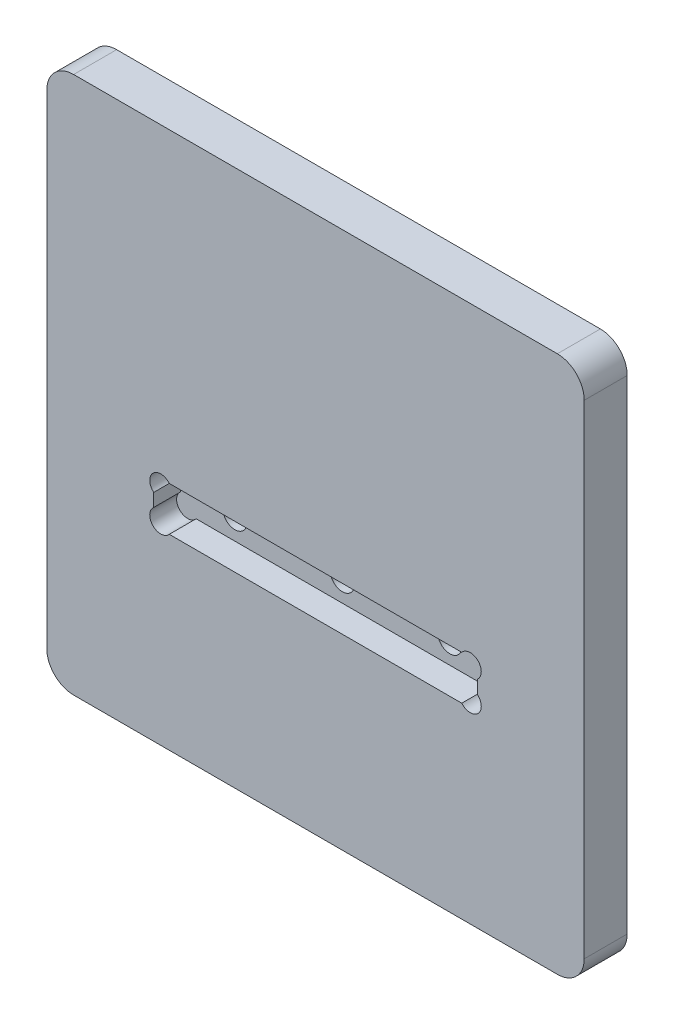
ISO-10303-21;
HEADER;
FILE_DESCRIPTION(('STEP AP214'),'2;1');
FILE_NAME('part.step','',(''),(''),'','','');
FILE_SCHEMA(('AUTOMOTIVE_DESIGN { 1 0 10303 214 1 1 1 1 }'));
ENDSEC;
DATA;
#1=APPLICATION_CONTEXT('core data for automotive mechanical design processes');
#2=APPLICATION_PROTOCOL_DEFINITION('international standard','automotive_design',2000,#1);
#3=PRODUCT_CONTEXT('',#1,'mechanical');
#4=PRODUCT('Part','Part','',(#3));
#5=PRODUCT_RELATED_PRODUCT_CATEGORY('part','',(#4));
#6=PRODUCT_DEFINITION_FORMATION('','',#4);
#7=PRODUCT_DEFINITION_CONTEXT('part definition',#1,'design');
#8=PRODUCT_DEFINITION('design','',#6,#7);
#9=PRODUCT_DEFINITION_SHAPE('','',#8);
#10=(LENGTH_UNIT() NAMED_UNIT(*) SI_UNIT(.MILLI.,.METRE.));
#11=(NAMED_UNIT(*) PLANE_ANGLE_UNIT() SI_UNIT($,.RADIAN.));
#12=(NAMED_UNIT(*) SI_UNIT($,.STERADIAN.) SOLID_ANGLE_UNIT());
#13=UNCERTAINTY_MEASURE_WITH_UNIT(LENGTH_MEASURE(1.E-05),#10,'distance_accuracy_value','');
#14=(GEOMETRIC_REPRESENTATION_CONTEXT(3) GLOBAL_UNCERTAINTY_ASSIGNED_CONTEXT((#13)) GLOBAL_UNIT_ASSIGNED_CONTEXT((#10,
#11,#12)) REPRESENTATION_CONTEXT('',''));
#15=CARTESIAN_POINT('',(0.,0.,0.));
#16=DIRECTION('',(0.,0.,1.));
#17=DIRECTION('',(1.,0.,0.));
#18=AXIS2_PLACEMENT_3D('',#15,#16,#17);
#19=CARTESIAN_POINT('',(0.,0.,8.));
#20=DIRECTION('',(1.,0.,0.));
#21=DIRECTION('',(0.,0.,-1.));
#22=AXIS2_PLACEMENT_3D('',#19,#20,#21);
#23=PLANE('',#22);
#24=DIRECTION('',(0.,-1.,0.));
#25=VECTOR('',#24,1.);
#26=CARTESIAN_POINT('',(0.,0.,0.));
#27=LINE('',#26,#25);
#28=CARTESIAN_POINT('',(0.,95.,0.));
#29=VERTEX_POINT('',#28);
#30=CARTESIAN_POINT('',(0.,5.,0.));
#31=VERTEX_POINT('',#30);
#32=EDGE_CURVE('E175',#29,#31,#27,.T.);
#33=ORIENTED_EDGE('',*,*,#32,.T.);
#34=DIRECTION('',(0.,0.,-1.));
#35=VECTOR('',#34,1.);
#36=CARTESIAN_POINT('',(0.,5.,8.));
#37=LINE('',#36,#35);
#38=CARTESIAN_POINT('',(0.,5.,8.));
#39=VERTEX_POINT('',#38);
#40=EDGE_CURVE('E242',#31,#39,#37,.F.);
#41=ORIENTED_EDGE('',*,*,#40,.T.);
#42=DIRECTION('',(0.,-1.,0.));
#43=VECTOR('',#42,1.);
#44=CARTESIAN_POINT('',(0.,0.,8.));
#45=LINE('',#44,#43);
#46=CARTESIAN_POINT('',(0.,95.,8.));
#47=VERTEX_POINT('',#46);
#48=EDGE_CURVE('E192',#47,#39,#45,.T.);
#49=ORIENTED_EDGE('',*,*,#48,.F.);
#50=DIRECTION('',(0.,0.,-1.));
#51=VECTOR('',#50,1.);
#52=CARTESIAN_POINT('',(0.,95.,8.));
#53=LINE('',#52,#51);
#54=EDGE_CURVE('E239',#47,#29,#53,.T.);
#55=ORIENTED_EDGE('',*,*,#54,.T.);
#56=EDGE_LOOP('',(#33,#41,#49,#55));
#57=FACE_BOUND('',#56,.T.);
#58=ADVANCED_FACE('F33',(#57),#23,.F.);
#59=CARTESIAN_POINT('',(0.,0.,8.));
#60=DIRECTION('',(0.,1.,0.));
#61=DIRECTION('',(0.,0.,1.));
#62=AXIS2_PLACEMENT_3D('',#59,#60,#61);
#63=PLANE('',#62);
#64=DIRECTION('',(1.,0.,0.));
#65=VECTOR('',#64,1.);
#66=CARTESIAN_POINT('',(0.,0.,0.));
#67=LINE('',#66,#65);
#68=CARTESIAN_POINT('',(5.,0.,0.));
#69=VERTEX_POINT('',#68);
#70=CARTESIAN_POINT('',(95.,0.,0.));
#71=VERTEX_POINT('',#70);
#72=EDGE_CURVE('E207',#69,#71,#67,.T.);
#73=ORIENTED_EDGE('',*,*,#72,.T.);
#74=DIRECTION('',(0.,0.,-1.));
#75=VECTOR('',#74,1.);
#76=CARTESIAN_POINT('',(95.,0.,8.));
#77=LINE('',#76,#75);
#78=CARTESIAN_POINT('',(95.,0.,8.));
#79=VERTEX_POINT('',#78);
#80=EDGE_CURVE('E229',#71,#79,#77,.F.);
#81=ORIENTED_EDGE('',*,*,#80,.T.);
#82=DIRECTION('',(1.,0.,0.));
#83=VECTOR('',#82,1.);
#84=CARTESIAN_POINT('',(0.,0.,8.));
#85=LINE('',#84,#83);
#86=CARTESIAN_POINT('',(5.,0.,8.));
#87=VERTEX_POINT('',#86);
#88=EDGE_CURVE('E195',#87,#79,#85,.T.);
#89=ORIENTED_EDGE('',*,*,#88,.F.);
#90=DIRECTION('',(0.,0.,-1.));
#91=VECTOR('',#90,1.);
#92=CARTESIAN_POINT('',(5.,0.,8.));
#93=LINE('',#92,#91);
#94=EDGE_CURVE('E226',#87,#69,#93,.T.);
#95=ORIENTED_EDGE('',*,*,#94,.T.);
#96=EDGE_LOOP('',(#73,#81,#89,#95));
#97=FACE_BOUND('',#96,.T.);
#98=ADVANCED_FACE('F319',(#97),#63,.F.);
#99=CARTESIAN_POINT('',(100.,0.,8.));
#100=DIRECTION('',(-1.,0.,0.));
#101=DIRECTION('',(0.,0.,1.));
#102=AXIS2_PLACEMENT_3D('',#99,#100,#101);
#103=PLANE('',#102);
#104=DIRECTION('',(0.,1.,0.));
#105=VECTOR('',#104,1.);
#106=CARTESIAN_POINT('',(100.,0.,8.));
#107=LINE('',#106,#105);
#108=CARTESIAN_POINT('',(100.,5.,8.));
#109=VERTEX_POINT('',#108);
#110=CARTESIAN_POINT('',(100.,95.,8.));
#111=VERTEX_POINT('',#110);
#112=EDGE_CURVE('E199',#109,#111,#107,.T.);
#113=ORIENTED_EDGE('',*,*,#112,.F.);
#114=DIRECTION('',(0.,0.,-1.));
#115=VECTOR('',#114,1.);
#116=CARTESIAN_POINT('',(100.,5.,8.));
#117=LINE('',#116,#115);
#118=CARTESIAN_POINT('',(100.,5.,0.));
#119=VERTEX_POINT('',#118);
#120=EDGE_CURVE('E215',#109,#119,#117,.T.);
#121=ORIENTED_EDGE('',*,*,#120,.T.);
#122=DIRECTION('',(0.,1.,0.));
#123=VECTOR('',#122,1.);
#124=CARTESIAN_POINT('',(100.,0.,0.));
#125=LINE('',#124,#123);
#126=CARTESIAN_POINT('',(100.,95.,0.));
#127=VERTEX_POINT('',#126);
#128=EDGE_CURVE('E210',#119,#127,#125,.T.);
#129=ORIENTED_EDGE('',*,*,#128,.T.);
#130=DIRECTION('',(0.,0.,-1.));
#131=VECTOR('',#130,1.);
#132=CARTESIAN_POINT('',(100.,95.,8.));
#133=LINE('',#132,#131);
#134=EDGE_CURVE('E204',#127,#111,#133,.F.);
#135=ORIENTED_EDGE('',*,*,#134,.T.);
#136=EDGE_LOOP('',(#113,#121,#129,#135));
#137=FACE_BOUND('',#136,.T.);
#138=ADVANCED_FACE('F325',(#137),#103,.F.);
#139=CARTESIAN_POINT('',(0.,100.,8.));
#140=DIRECTION('',(0.,-1.,0.));
#141=DIRECTION('',(0.,0.,-1.));
#142=AXIS2_PLACEMENT_3D('',#139,#140,#141);
#143=PLANE('',#142);
#144=DIRECTION('',(-1.,0.,0.));
#145=VECTOR('',#144,1.);
#146=CARTESIAN_POINT('',(0.,100.,0.));
#147=LINE('',#146,#145);
#148=CARTESIAN_POINT('',(95.,100.,0.));
#149=VERTEX_POINT('',#148);
#150=CARTESIAN_POINT('',(5.,100.,0.));
#151=VERTEX_POINT('',#150);
#152=EDGE_CURVE('E196',#149,#151,#147,.T.);
#153=ORIENTED_EDGE('',*,*,#152,.T.);
#154=DIRECTION('',(0.,0.,-1.));
#155=VECTOR('',#154,1.);
#156=CARTESIAN_POINT('',(5.,100.,8.));
#157=LINE('',#156,#155);
#158=CARTESIAN_POINT('',(5.,100.,8.));
#159=VERTEX_POINT('',#158);
#160=EDGE_CURVE('E11',#151,#159,#157,.F.);
#161=ORIENTED_EDGE('',*,*,#160,.T.);
#162=DIRECTION('',(-1.,0.,0.));
#163=VECTOR('',#162,1.);
#164=CARTESIAN_POINT('',(0.,100.,8.));
#165=LINE('',#164,#163);
#166=CARTESIAN_POINT('',(95.,100.,8.));
#167=VERTEX_POINT('',#166);
#168=EDGE_CURVE('E202',#167,#159,#165,.T.);
#169=ORIENTED_EDGE('',*,*,#168,.F.);
#170=DIRECTION('',(0.,0.,-1.));
#171=VECTOR('',#170,1.);
#172=CARTESIAN_POINT('',(95.,100.,8.));
#173=LINE('',#172,#171);
#174=EDGE_CURVE('E42',#167,#149,#173,.T.);
#175=ORIENTED_EDGE('',*,*,#174,.T.);
#176=EDGE_LOOP('',(#153,#161,#169,#175));
#177=FACE_BOUND('',#176,.T.);
#178=ADVANCED_FACE('F362',(#177),#143,.F.);
#179=CARTESIAN_POINT('',(0.,0.,8.));
#180=DIRECTION('',(0.,0.,-1.));
#181=DIRECTION('',(-1.,0.,0.));
#182=AXIS2_PLACEMENT_3D('',#179,#180,#181);
#183=PLANE('',#182);
#184=DIRECTION('',(0.,1.,0.));
#185=VECTOR('',#184,1.);
#186=CARTESIAN_POINT('',(80.1,43.,8.));
#187=LINE('',#186,#185);
#188=CARTESIAN_POINT('',(80.1,37.6865169569615,8.));
#189=VERTEX_POINT('',#188);
#190=CARTESIAN_POINT('',(80.1,40.1134830430385,8.));
#191=VERTEX_POINT('',#190);
#192=EDGE_CURVE('E187',#189,#191,#187,.T.);
#193=ORIENTED_EDGE('',*,*,#192,.F.);
#194=CARTESIAN_POINT('',(78.7918524548049,36.1081475451951,8.));
#195=DIRECTION('',(0.,0.,1.));
#196=DIRECTION('',(1.,0.,0.));
#197=AXIS2_PLACEMENT_3D('',#194,#195,#196);
#198=CIRCLE('',#197,2.05);
#199=CARTESIAN_POINT('',(77.2134830430384,34.8,8.));
#200=VERTEX_POINT('',#199);
#201=EDGE_CURVE('E154',#200,#189,#198,.T.);
#202=ORIENTED_EDGE('',*,*,#201,.F.);
#203=DIRECTION('',(1.,0.,0.));
#204=VECTOR('',#203,1.);
#205=CARTESIAN_POINT('',(19.9,34.8,8.));
#206=LINE('',#205,#204);
#207=CARTESIAN_POINT('',(22.7865169569616,34.8,8.));
#208=VERTEX_POINT('',#207);
#209=EDGE_CURVE('E184',#208,#200,#206,.T.);
#210=ORIENTED_EDGE('',*,*,#209,.F.);
#211=CARTESIAN_POINT('',(21.2081475451951,36.1081475451951,8.));
#212=DIRECTION('',(0.,0.,1.));
#213=DIRECTION('',(-1.,0.,0.));
#214=AXIS2_PLACEMENT_3D('',#211,#212,#213);
#215=CIRCLE('',#214,2.05);
#216=CARTESIAN_POINT('',(19.9,37.6865169569616,8.));
#217=VERTEX_POINT('',#216);
#218=EDGE_CURVE('E272',#217,#208,#215,.T.);
#219=ORIENTED_EDGE('',*,*,#218,.F.);
#220=DIRECTION('',(0.,-1.,0.));
#221=VECTOR('',#220,1.);
#222=CARTESIAN_POINT('',(19.9,43.,8.));
#223=LINE('',#222,#221);
#224=CARTESIAN_POINT('',(19.9,40.1134830430384,8.));
#225=VERTEX_POINT('',#224);
#226=EDGE_CURVE('E181',#225,#217,#223,.T.);
#227=ORIENTED_EDGE('',*,*,#226,.F.);
#228=CARTESIAN_POINT('',(21.2081475451951,41.6918524548049,8.));
#229=DIRECTION('',(0.,0.,1.));
#230=DIRECTION('',(1.,0.,0.));
#231=AXIS2_PLACEMENT_3D('',#228,#229,#230);
#232=CIRCLE('',#231,2.05);
#233=CARTESIAN_POINT('',(22.7865169569616,43.,8.));
#234=VERTEX_POINT('',#233);
#235=EDGE_CURVE('E248',#234,#225,#232,.T.);
#236=ORIENTED_EDGE('',*,*,#235,.F.);
#237=DIRECTION('',(-1.,0.,0.));
#238=VECTOR('',#237,1.);
#239=CARTESIAN_POINT('',(19.9,43.,8.));
#240=LINE('',#239,#238);
#241=CARTESIAN_POINT('',(77.2134830430384,43.,8.));
#242=VERTEX_POINT('',#241);
#243=EDGE_CURVE('E189',#242,#234,#240,.T.);
#244=ORIENTED_EDGE('',*,*,#243,.F.);
#245=CARTESIAN_POINT('',(78.7918524548049,41.6918524548049,8.));
#246=DIRECTION('',(0.,0.,1.));
#247=DIRECTION('',(-1.,0.,0.));
#248=AXIS2_PLACEMENT_3D('',#245,#246,#247);
#249=CIRCLE('',#248,2.05);
#250=EDGE_CURVE('E268',#191,#242,#249,.T.);
#251=ORIENTED_EDGE('',*,*,#250,.F.);
#252=EDGE_LOOP('',(#193,#202,#210,#219,#227,#236,#244,#251));
#253=FACE_BOUND('',#252,.T.);
#254=ORIENTED_EDGE('',*,*,#88,.T.);
#255=CARTESIAN_POINT('',(95.,5.,8.));
#256=DIRECTION('',(0.,0.,-1.));
#257=DIRECTION('',(-1.,0.,0.));
#258=AXIS2_PLACEMENT_3D('',#255,#256,#257);
#259=CIRCLE('',#258,5.);
#260=EDGE_CURVE('E237',#79,#109,#259,.F.);
#261=ORIENTED_EDGE('',*,*,#260,.T.);
#262=ORIENTED_EDGE('',*,*,#112,.T.);
#263=CARTESIAN_POINT('',(95.,95.,8.));
#264=DIRECTION('',(0.,0.,-1.));
#265=DIRECTION('',(-1.,0.,0.));
#266=AXIS2_PLACEMENT_3D('',#263,#264,#265);
#267=CIRCLE('',#266,5.);
#268=EDGE_CURVE('E231',#111,#167,#267,.F.);
#269=ORIENTED_EDGE('',*,*,#268,.T.);
#270=ORIENTED_EDGE('',*,*,#168,.T.);
#271=CARTESIAN_POINT('',(5.,95.,8.));
#272=DIRECTION('',(0.,0.,-1.));
#273=DIRECTION('',(-1.,0.,0.));
#274=AXIS2_PLACEMENT_3D('',#271,#272,#273);
#275=CIRCLE('',#274,5.);
#276=EDGE_CURVE('E233',#159,#47,#275,.F.);
#277=ORIENTED_EDGE('',*,*,#276,.T.);
#278=ORIENTED_EDGE('',*,*,#48,.T.);
#279=CARTESIAN_POINT('',(5.,5.,8.));
#280=DIRECTION('',(0.,0.,-1.));
#281=DIRECTION('',(-1.,0.,0.));
#282=AXIS2_PLACEMENT_3D('',#279,#280,#281);
#283=CIRCLE('',#282,5.);
#284=EDGE_CURVE('E235',#39,#87,#283,.F.);
#285=ORIENTED_EDGE('',*,*,#284,.T.);
#286=EDGE_LOOP('',(#254,#261,#262,#269,#270,#277,#278,#285));
#287=FACE_BOUND('',#286,.T.);
#288=ADVANCED_FACE('F301',(#253,#287),#183,.F.);
#289=CARTESIAN_POINT('',(0.,0.,0.));
#290=DIRECTION('',(0.,0.,-1.));
#291=DIRECTION('',(-1.,0.,0.));
#292=AXIS2_PLACEMENT_3D('',#289,#290,#291);
#293=PLANE('',#292);
#294=CARTESIAN_POINT('',(70.,38.9,0.));
#295=DIRECTION('',(0.,0.,1.));
#296=DIRECTION('',(1.,0.,0.));
#297=AXIS2_PLACEMENT_3D('',#294,#295,#296);
#298=CIRCLE('',#297,2.25);
#299=CARTESIAN_POINT('',(72.25,38.9,0.));
#300=VERTEX_POINT('',#299);
#301=EDGE_CURVE('E252',#300,#300,#298,.T.);
#302=ORIENTED_EDGE('',*,*,#301,.T.);
#303=EDGE_LOOP('',(#302));
#304=FACE_BOUND('',#303,.T.);
#305=CARTESIAN_POINT('',(30.,38.9,0.));
#306=DIRECTION('',(0.,0.,1.));
#307=DIRECTION('',(-1.,0.,0.));
#308=AXIS2_PLACEMENT_3D('',#305,#306,#307);
#309=CIRCLE('',#308,2.25);
#310=CARTESIAN_POINT('',(27.75,38.9,0.));
#311=VERTEX_POINT('',#310);
#312=EDGE_CURVE('E257',#311,#311,#309,.T.);
#313=ORIENTED_EDGE('',*,*,#312,.T.);
#314=EDGE_LOOP('',(#313));
#315=FACE_BOUND('',#314,.T.);
#316=CARTESIAN_POINT('',(50.,38.9,0.));
#317=DIRECTION('',(0.,0.,1.));
#318=DIRECTION('',(1.,0.,0.));
#319=AXIS2_PLACEMENT_3D('',#316,#317,#318);
#320=CIRCLE('',#319,2.25);
#321=CARTESIAN_POINT('',(52.25,38.9,0.));
#322=VERTEX_POINT('',#321);
#323=EDGE_CURVE('E249',#322,#322,#320,.T.);
#324=ORIENTED_EDGE('',*,*,#323,.T.);
#325=EDGE_LOOP('',(#324));
#326=FACE_BOUND('',#325,.T.);
#327=ORIENTED_EDGE('',*,*,#128,.F.);
#328=CARTESIAN_POINT('',(95.,5.,0.));
#329=DIRECTION('',(0.,0.,-1.));
#330=DIRECTION('',(-1.,0.,0.));
#331=AXIS2_PLACEMENT_3D('',#328,#329,#330);
#332=CIRCLE('',#331,5.);
#333=EDGE_CURVE('E224',#119,#71,#332,.T.);
#334=ORIENTED_EDGE('',*,*,#333,.T.);
#335=ORIENTED_EDGE('',*,*,#72,.F.);
#336=CARTESIAN_POINT('',(5.,5.,0.));
#337=DIRECTION('',(0.,0.,-1.));
#338=DIRECTION('',(-1.,0.,0.));
#339=AXIS2_PLACEMENT_3D('',#336,#337,#338);
#340=CIRCLE('',#339,5.);
#341=EDGE_CURVE('E222',#69,#31,#340,.T.);
#342=ORIENTED_EDGE('',*,*,#341,.T.);
#343=ORIENTED_EDGE('',*,*,#32,.F.);
#344=CARTESIAN_POINT('',(5.,95.,0.));
#345=DIRECTION('',(0.,0.,-1.));
#346=DIRECTION('',(-1.,0.,0.));
#347=AXIS2_PLACEMENT_3D('',#344,#345,#346);
#348=CIRCLE('',#347,5.);
#349=EDGE_CURVE('E220',#29,#151,#348,.T.);
#350=ORIENTED_EDGE('',*,*,#349,.T.);
#351=ORIENTED_EDGE('',*,*,#152,.F.);
#352=CARTESIAN_POINT('',(95.,95.,0.));
#353=DIRECTION('',(0.,0.,-1.));
#354=DIRECTION('',(-1.,0.,0.));
#355=AXIS2_PLACEMENT_3D('',#352,#353,#354);
#356=CIRCLE('',#355,5.);
#357=EDGE_CURVE('E218',#149,#127,#356,.T.);
#358=ORIENTED_EDGE('',*,*,#357,.T.);
#359=EDGE_LOOP('',(#327,#334,#335,#342,#343,#350,#351,#358));
#360=FACE_BOUND('',#359,.T.);
#361=ADVANCED_FACE('F365',(#304,#315,#326,#360),#293,.T.);
#362=CARTESIAN_POINT('',(19.9,43.,3.));
#363=DIRECTION('',(-1.,0.,0.));
#364=DIRECTION('',(0.,-1.,0.));
#365=AXIS2_PLACEMENT_3D('',#362,#363,#364);
#366=PLANE('',#365);
#367=ORIENTED_EDGE('',*,*,#226,.T.);
#368=DIRECTION('',(0.,0.,1.));
#369=VECTOR('',#368,1.);
#370=CARTESIAN_POINT('',(19.9,37.6865169569616,3.));
#371=LINE('',#370,#369);
#372=CARTESIAN_POINT('',(19.9,37.6865169569616,3.));
#373=VERTEX_POINT('',#372);
#374=EDGE_CURVE('E267',#373,#217,#371,.T.);
#375=ORIENTED_EDGE('',*,*,#374,.F.);
#376=DIRECTION('',(0.,-1.,0.));
#377=VECTOR('',#376,1.);
#378=CARTESIAN_POINT('',(19.9,43.,3.));
#379=LINE('',#378,#377);
#380=CARTESIAN_POINT('',(19.9,40.1134830430384,3.));
#381=VERTEX_POINT('',#380);
#382=EDGE_CURVE('E177',#381,#373,#379,.T.);
#383=ORIENTED_EDGE('',*,*,#382,.F.);
#384=DIRECTION('',(0.,0.,1.));
#385=VECTOR('',#384,1.);
#386=CARTESIAN_POINT('',(19.9,40.1134830430384,3.));
#387=LINE('',#386,#385);
#388=EDGE_CURVE('E280',#381,#225,#387,.T.);
#389=ORIENTED_EDGE('',*,*,#388,.T.);
#390=EDGE_LOOP('',(#367,#375,#383,#389));
#391=FACE_BOUND('',#390,.T.);
#392=ADVANCED_FACE('F294',(#391),#366,.F.);
#393=CARTESIAN_POINT('',(19.9,43.,3.));
#394=DIRECTION('',(0.,1.,0.));
#395=DIRECTION('',(-1.,0.,0.));
#396=AXIS2_PLACEMENT_3D('',#393,#394,#395);
#397=PLANE('',#396);
#398=ORIENTED_EDGE('',*,*,#243,.T.);
#399=DIRECTION('',(0.,0.,1.));
#400=VECTOR('',#399,1.);
#401=CARTESIAN_POINT('',(22.7865169569616,43.,3.));
#402=LINE('',#401,#400);
#403=CARTESIAN_POINT('',(22.7865169569616,43.,3.));
#404=VERTEX_POINT('',#403);
#405=EDGE_CURVE('E274',#404,#234,#402,.T.);
#406=ORIENTED_EDGE('',*,*,#405,.F.);
#407=DIRECTION('',(-1.,0.,0.));
#408=VECTOR('',#407,1.);
#409=CARTESIAN_POINT('',(19.9,43.,3.));
#410=LINE('',#409,#408);
#411=CARTESIAN_POINT('',(77.2134830430384,43.,3.));
#412=VERTEX_POINT('',#411);
#413=EDGE_CURVE('E172',#412,#404,#410,.T.);
#414=ORIENTED_EDGE('',*,*,#413,.F.);
#415=DIRECTION('',(0.,0.,1.));
#416=VECTOR('',#415,1.);
#417=CARTESIAN_POINT('',(77.2134830430384,43.,3.));
#418=LINE('',#417,#416);
#419=EDGE_CURVE('E287',#412,#242,#418,.T.);
#420=ORIENTED_EDGE('',*,*,#419,.T.);
#421=EDGE_LOOP('',(#398,#406,#414,#420));
#422=FACE_BOUND('',#421,.T.);
#423=ADVANCED_FACE('F315',(#422),#397,.F.);
#424=CARTESIAN_POINT('',(80.1,43.,3.));
#425=DIRECTION('',(1.,0.,0.));
#426=DIRECTION('',(0.,0.,-1.));
#427=AXIS2_PLACEMENT_3D('',#424,#425,#426);
#428=PLANE('',#427);
#429=DIRECTION('',(0.,1.,0.));
#430=VECTOR('',#429,1.);
#431=CARTESIAN_POINT('',(80.1,43.,3.));
#432=LINE('',#431,#430);
#433=CARTESIAN_POINT('',(80.1,37.6865169569615,3.));
#434=VERTEX_POINT('',#433);
#435=CARTESIAN_POINT('',(80.1,40.1134830430385,3.));
#436=VERTEX_POINT('',#435);
#437=EDGE_CURVE('E163',#434,#436,#432,.T.);
#438=ORIENTED_EDGE('',*,*,#437,.F.);
#439=DIRECTION('',(0.,0.,1.));
#440=VECTOR('',#439,1.);
#441=CARTESIAN_POINT('',(80.1,37.6865169569615,3.));
#442=LINE('',#441,#440);
#443=EDGE_CURVE('E148',#434,#189,#442,.T.);
#444=ORIENTED_EDGE('',*,*,#443,.T.);
#445=ORIENTED_EDGE('',*,*,#192,.T.);
#446=DIRECTION('',(0.,0.,1.));
#447=VECTOR('',#446,1.);
#448=CARTESIAN_POINT('',(80.1,40.1134830430385,3.));
#449=LINE('',#448,#447);
#450=EDGE_CURVE('E171',#436,#191,#449,.T.);
#451=ORIENTED_EDGE('',*,*,#450,.F.);
#452=EDGE_LOOP('',(#438,#444,#445,#451));
#453=FACE_BOUND('',#452,.T.);
#454=ADVANCED_FACE('F169',(#453),#428,.F.);
#455=CARTESIAN_POINT('',(19.9,34.8,3.));
#456=DIRECTION('',(0.,-1.,0.));
#457=DIRECTION('',(1.,0.,0.));
#458=AXIS2_PLACEMENT_3D('',#455,#456,#457);
#459=PLANE('',#458);
#460=ORIENTED_EDGE('',*,*,#209,.T.);
#461=DIRECTION('',(0.,0.,1.));
#462=VECTOR('',#461,1.);
#463=CARTESIAN_POINT('',(77.2134830430384,34.8,3.));
#464=LINE('',#463,#462);
#465=CARTESIAN_POINT('',(77.2134830430384,34.8,3.));
#466=VERTEX_POINT('',#465);
#467=EDGE_CURVE('E158',#466,#200,#464,.T.);
#468=ORIENTED_EDGE('',*,*,#467,.F.);
#469=DIRECTION('',(1.,0.,0.));
#470=VECTOR('',#469,1.);
#471=CARTESIAN_POINT('',(19.9,34.8,3.));
#472=LINE('',#471,#470);
#473=CARTESIAN_POINT('',(22.7865169569616,34.8,3.));
#474=VERTEX_POINT('',#473);
#475=EDGE_CURVE('E166',#474,#466,#472,.T.);
#476=ORIENTED_EDGE('',*,*,#475,.F.);
#477=DIRECTION('',(0.,0.,1.));
#478=VECTOR('',#477,1.);
#479=CARTESIAN_POINT('',(22.7865169569616,34.8,3.));
#480=LINE('',#479,#478);
#481=EDGE_CURVE('E271',#474,#208,#480,.T.);
#482=ORIENTED_EDGE('',*,*,#481,.T.);
#483=EDGE_LOOP('',(#460,#468,#476,#482));
#484=FACE_BOUND('',#483,.T.);
#485=ADVANCED_FACE('F305',(#484),#459,.F.);
#486=CARTESIAN_POINT('',(0.,0.,3.));
#487=DIRECTION('',(0.,0.,1.));
#488=DIRECTION('',(1.,0.,0.));
#489=AXIS2_PLACEMENT_3D('',#486,#487,#488);
#490=PLANE('',#489);
#491=CARTESIAN_POINT('',(70.,38.9,3.));
#492=DIRECTION('',(0.,0.,1.));
#493=DIRECTION('',(1.,0.,0.));
#494=AXIS2_PLACEMENT_3D('',#491,#492,#493);
#495=CIRCLE('',#494,2.25);
#496=CARTESIAN_POINT('',(72.25,38.9,3.));
#497=VERTEX_POINT('',#496);
#498=EDGE_CURVE('E37',#497,#497,#495,.T.);
#499=ORIENTED_EDGE('',*,*,#498,.F.);
#500=EDGE_LOOP('',(#499));
#501=FACE_BOUND('',#500,.T.);
#502=CARTESIAN_POINT('',(30.,38.9,3.));
#503=DIRECTION('',(0.,0.,1.));
#504=DIRECTION('',(1.,0.,0.));
#505=AXIS2_PLACEMENT_3D('',#502,#503,#504);
#506=CIRCLE('',#505,2.25);
#507=CARTESIAN_POINT('',(32.25,38.9,3.));
#508=VERTEX_POINT('',#507);
#509=EDGE_CURVE('E250',#508,#508,#506,.T.);
#510=ORIENTED_EDGE('',*,*,#509,.F.);
#511=EDGE_LOOP('',(#510));
#512=FACE_BOUND('',#511,.T.);
#513=CARTESIAN_POINT('',(50.,38.9,3.));
#514=DIRECTION('',(0.,0.,1.));
#515=DIRECTION('',(1.,0.,0.));
#516=AXIS2_PLACEMENT_3D('',#513,#514,#515);
#517=CIRCLE('',#516,2.25);
#518=CARTESIAN_POINT('',(52.25,38.9,3.));
#519=VERTEX_POINT('',#518);
#520=EDGE_CURVE('E246',#519,#519,#517,.T.);
#521=ORIENTED_EDGE('',*,*,#520,.F.);
#522=EDGE_LOOP('',(#521));
#523=FACE_BOUND('',#522,.T.);
#524=CARTESIAN_POINT('',(21.2081475451951,41.6918524548049,3.));
#525=DIRECTION('',(0.,0.,1.));
#526=DIRECTION('',(1.,0.,0.));
#527=AXIS2_PLACEMENT_3D('',#524,#525,#526);
#528=CIRCLE('',#527,2.05);
#529=EDGE_CURVE('E278',#404,#381,#528,.T.);
#530=ORIENTED_EDGE('',*,*,#529,.T.);
#531=ORIENTED_EDGE('',*,*,#382,.T.);
#532=CARTESIAN_POINT('',(21.2081475451951,36.1081475451951,3.));
#533=DIRECTION('',(0.,0.,1.));
#534=DIRECTION('',(-1.,0.,0.));
#535=AXIS2_PLACEMENT_3D('',#532,#533,#534);
#536=CIRCLE('',#535,2.05);
#537=EDGE_CURVE('E50',#373,#474,#536,.T.);
#538=ORIENTED_EDGE('',*,*,#537,.T.);
#539=ORIENTED_EDGE('',*,*,#475,.T.);
#540=CARTESIAN_POINT('',(78.7918524548049,36.1081475451951,3.));
#541=DIRECTION('',(0.,0.,1.));
#542=DIRECTION('',(1.,0.,0.));
#543=AXIS2_PLACEMENT_3D('',#540,#541,#542);
#544=CIRCLE('',#543,2.05);
#545=EDGE_CURVE('E151',#466,#434,#544,.T.);
#546=ORIENTED_EDGE('',*,*,#545,.T.);
#547=ORIENTED_EDGE('',*,*,#437,.T.);
#548=CARTESIAN_POINT('',(78.7918524548049,41.6918524548049,3.));
#549=DIRECTION('',(0.,0.,1.));
#550=DIRECTION('',(-1.,0.,0.));
#551=AXIS2_PLACEMENT_3D('',#548,#549,#550);
#552=CIRCLE('',#551,2.05);
#553=EDGE_CURVE('E285',#436,#412,#552,.T.);
#554=ORIENTED_EDGE('',*,*,#553,.T.);
#555=ORIENTED_EDGE('',*,*,#413,.T.);
#556=EDGE_LOOP('',(#530,#531,#538,#539,#546,#547,#554,#555));
#557=FACE_BOUND('',#556,.T.);
#558=ADVANCED_FACE('F161',(#501,#512,#523,#557),#490,.T.);
#559=CARTESIAN_POINT('',(95.,5.,8.));
#560=DIRECTION('',(0.,0.,-1.));
#561=DIRECTION('',(-1.,0.,0.));
#562=AXIS2_PLACEMENT_3D('',#559,#560,#561);
#563=CYLINDRICAL_SURFACE('',#562,5.);
#564=ORIENTED_EDGE('',*,*,#260,.F.);
#565=ORIENTED_EDGE('',*,*,#80,.F.);
#566=ORIENTED_EDGE('',*,*,#333,.F.);
#567=ORIENTED_EDGE('',*,*,#120,.F.);
#568=EDGE_LOOP('',(#564,#565,#566,#567));
#569=FACE_BOUND('',#568,.T.);
#570=ADVANCED_FACE('F312',(#569),#563,.T.);
#571=CARTESIAN_POINT('',(5.,5.,8.));
#572=DIRECTION('',(0.,0.,-1.));
#573=DIRECTION('',(-1.,0.,0.));
#574=AXIS2_PLACEMENT_3D('',#571,#572,#573);
#575=CYLINDRICAL_SURFACE('',#574,5.);
#576=ORIENTED_EDGE('',*,*,#284,.F.);
#577=ORIENTED_EDGE('',*,*,#40,.F.);
#578=ORIENTED_EDGE('',*,*,#341,.F.);
#579=ORIENTED_EDGE('',*,*,#94,.F.);
#580=EDGE_LOOP('',(#576,#577,#578,#579));
#581=FACE_BOUND('',#580,.T.);
#582=ADVANCED_FACE('F332',(#581),#575,.T.);
#583=CARTESIAN_POINT('',(5.,95.,8.));
#584=DIRECTION('',(0.,0.,-1.));
#585=DIRECTION('',(-1.,0.,0.));
#586=AXIS2_PLACEMENT_3D('',#583,#584,#585);
#587=CYLINDRICAL_SURFACE('',#586,5.);
#588=ORIENTED_EDGE('',*,*,#276,.F.);
#589=ORIENTED_EDGE('',*,*,#160,.F.);
#590=ORIENTED_EDGE('',*,*,#349,.F.);
#591=ORIENTED_EDGE('',*,*,#54,.F.);
#592=EDGE_LOOP('',(#588,#589,#590,#591));
#593=FACE_BOUND('',#592,.T.);
#594=ADVANCED_FACE('F335',(#593),#587,.T.);
#595=CARTESIAN_POINT('',(95.,95.,8.));
#596=DIRECTION('',(0.,0.,-1.));
#597=DIRECTION('',(-1.,0.,0.));
#598=AXIS2_PLACEMENT_3D('',#595,#596,#597);
#599=CYLINDRICAL_SURFACE('',#598,5.);
#600=ORIENTED_EDGE('',*,*,#268,.F.);
#601=ORIENTED_EDGE('',*,*,#134,.F.);
#602=ORIENTED_EDGE('',*,*,#357,.F.);
#603=ORIENTED_EDGE('',*,*,#174,.F.);
#604=EDGE_LOOP('',(#600,#601,#602,#603));
#605=FACE_BOUND('',#604,.T.);
#606=ADVANCED_FACE('F35',(#605),#599,.T.);
#607=CARTESIAN_POINT('',(78.7918524548049,41.6918524548049,3.));
#608=DIRECTION('',(0.,0.,1.));
#609=DIRECTION('',(1.,0.,0.));
#610=AXIS2_PLACEMENT_3D('',#607,#608,#609);
#611=CYLINDRICAL_SURFACE('',#610,2.05);
#612=ORIENTED_EDGE('',*,*,#250,.T.);
#613=ORIENTED_EDGE('',*,*,#419,.F.);
#614=ORIENTED_EDGE('',*,*,#553,.F.);
#615=ORIENTED_EDGE('',*,*,#450,.T.);
#616=EDGE_LOOP('',(#612,#613,#614,#615));
#617=FACE_BOUND('',#616,.T.);
#618=ADVANCED_FACE('F342',(#617),#611,.F.);
#619=CARTESIAN_POINT('',(21.2081475451951,36.1081475451951,3.));
#620=DIRECTION('',(0.,0.,1.));
#621=DIRECTION('',(1.,0.,0.));
#622=AXIS2_PLACEMENT_3D('',#619,#620,#621);
#623=CYLINDRICAL_SURFACE('',#622,2.05);
#624=ORIENTED_EDGE('',*,*,#218,.T.);
#625=ORIENTED_EDGE('',*,*,#481,.F.);
#626=ORIENTED_EDGE('',*,*,#537,.F.);
#627=ORIENTED_EDGE('',*,*,#374,.T.);
#628=EDGE_LOOP('',(#624,#625,#626,#627));
#629=FACE_BOUND('',#628,.T.);
#630=ADVANCED_FACE('F298',(#629),#623,.F.);
#631=CARTESIAN_POINT('',(78.7918524548049,36.1081475451951,3.));
#632=DIRECTION('',(0.,0.,1.));
#633=DIRECTION('',(1.,0.,0.));
#634=AXIS2_PLACEMENT_3D('',#631,#632,#633);
#635=CYLINDRICAL_SURFACE('',#634,2.05);
#636=ORIENTED_EDGE('',*,*,#201,.T.);
#637=ORIENTED_EDGE('',*,*,#443,.F.);
#638=ORIENTED_EDGE('',*,*,#545,.F.);
#639=ORIENTED_EDGE('',*,*,#467,.T.);
#640=EDGE_LOOP('',(#636,#637,#638,#639));
#641=FACE_BOUND('',#640,.T.);
#642=ADVANCED_FACE('F150',(#641),#635,.F.);
#643=CARTESIAN_POINT('',(21.2081475451951,41.6918524548049,3.));
#644=DIRECTION('',(0.,0.,1.));
#645=DIRECTION('',(1.,0.,0.));
#646=AXIS2_PLACEMENT_3D('',#643,#644,#645);
#647=CYLINDRICAL_SURFACE('',#646,2.05);
#648=ORIENTED_EDGE('',*,*,#235,.T.);
#649=ORIENTED_EDGE('',*,*,#388,.F.);
#650=ORIENTED_EDGE('',*,*,#529,.F.);
#651=ORIENTED_EDGE('',*,*,#405,.T.);
#652=EDGE_LOOP('',(#648,#649,#650,#651));
#653=FACE_BOUND('',#652,.T.);
#654=ADVANCED_FACE('F447',(#653),#647,.F.);
#655=CARTESIAN_POINT('',(50.,38.9,0.));
#656=DIRECTION('',(0.,0.,1.));
#657=DIRECTION('',(1.,0.,0.));
#658=AXIS2_PLACEMENT_3D('',#655,#656,#657);
#659=CYLINDRICAL_SURFACE('',#658,2.25);
#660=ORIENTED_EDGE('',*,*,#520,.T.);
#661=EDGE_LOOP('',(#660));
#662=FACE_BOUND('',#661,.T.);
#663=ORIENTED_EDGE('',*,*,#323,.F.);
#664=EDGE_LOOP('',(#663));
#665=FACE_BOUND('',#664,.T.);
#666=ADVANCED_FACE('F455',(#662,#665),#659,.F.);
#667=CARTESIAN_POINT('',(30.,38.9,0.));
#668=DIRECTION('',(0.,0.,1.));
#669=DIRECTION('',(1.,0.,0.));
#670=AXIS2_PLACEMENT_3D('',#667,#668,#669);
#671=CYLINDRICAL_SURFACE('',#670,2.25);
#672=ORIENTED_EDGE('',*,*,#509,.T.);
#673=EDGE_LOOP('',(#672));
#674=FACE_BOUND('',#673,.T.);
#675=ORIENTED_EDGE('',*,*,#312,.F.);
#676=EDGE_LOOP('',(#675));
#677=FACE_BOUND('',#676,.T.);
#678=ADVANCED_FACE('F474',(#674,#677),#671,.F.);
#679=CARTESIAN_POINT('',(70.,38.9,0.));
#680=DIRECTION('',(0.,0.,1.));
#681=DIRECTION('',(1.,0.,0.));
#682=AXIS2_PLACEMENT_3D('',#679,#680,#681);
#683=CYLINDRICAL_SURFACE('',#682,2.25);
#684=ORIENTED_EDGE('',*,*,#498,.T.);
#685=EDGE_LOOP('',(#684));
#686=FACE_BOUND('',#685,.T.);
#687=ORIENTED_EDGE('',*,*,#301,.F.);
#688=EDGE_LOOP('',(#687));
#689=FACE_BOUND('',#688,.T.);
#690=ADVANCED_FACE('F484',(#686,#689),#683,.F.);
#691=CLOSED_SHELL('',(#58,#98,#138,#178,#288,#361,#392,#423,#454,#485,#558,#570,#582,#594,#606,
#618,#630,#642,#654,#666,#678,#690));
#692=MANIFOLD_SOLID_BREP('B2',#691);
#693=ADVANCED_BREP_SHAPE_REPRESENTATION('',(#18,#692),#14);
#694=SHAPE_DEFINITION_REPRESENTATION(#9,#693);
ENDSEC;
END-ISO-10303-21;
